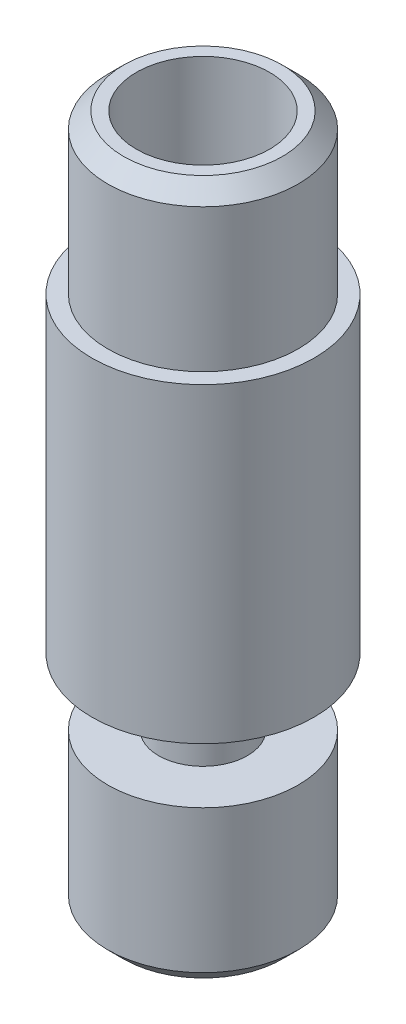
ISO-10303-21;
HEADER;
FILE_DESCRIPTION(('STEP AP214'),'2;1');
FILE_NAME('part.step','',(''),(''),'','','');
FILE_SCHEMA(('AUTOMOTIVE_DESIGN { 1 0 10303 214 1 1 1 1 }'));
ENDSEC;
DATA;
#1=APPLICATION_CONTEXT('core data for automotive mechanical design processes');
#2=APPLICATION_PROTOCOL_DEFINITION('international standard','automotive_design',2000,#1);
#3=PRODUCT_CONTEXT('',#1,'mechanical');
#4=PRODUCT('Part','Part','',(#3));
#5=PRODUCT_RELATED_PRODUCT_CATEGORY('part','',(#4));
#6=PRODUCT_DEFINITION_FORMATION('','',#4);
#7=PRODUCT_DEFINITION_CONTEXT('part definition',#1,'design');
#8=PRODUCT_DEFINITION('design','',#6,#7);
#9=PRODUCT_DEFINITION_SHAPE('','',#8);
#10=(LENGTH_UNIT() NAMED_UNIT(*) SI_UNIT(.MILLI.,.METRE.));
#11=(NAMED_UNIT(*) PLANE_ANGLE_UNIT() SI_UNIT($,.RADIAN.));
#12=(NAMED_UNIT(*) SI_UNIT($,.STERADIAN.) SOLID_ANGLE_UNIT());
#13=UNCERTAINTY_MEASURE_WITH_UNIT(LENGTH_MEASURE(1.E-05),#10,'distance_accuracy_value','');
#14=(GEOMETRIC_REPRESENTATION_CONTEXT(3) GLOBAL_UNCERTAINTY_ASSIGNED_CONTEXT((#13)) GLOBAL_UNIT_ASSIGNED_CONTEXT((#10,
#11,#12)) REPRESENTATION_CONTEXT('',''));
#15=CARTESIAN_POINT('',(0.,0.,0.));
#16=DIRECTION('',(0.,0.,1.));
#17=DIRECTION('',(1.,0.,0.));
#18=AXIS2_PLACEMENT_3D('',#15,#16,#17);
#19=CARTESIAN_POINT('',(0.,0.499999999999998,0.));
#20=DIRECTION('',(0.,1.,0.));
#21=DIRECTION('',(0.,0.,1.));
#22=AXIS2_PLACEMENT_3D('',#19,#20,#21);
#23=CONICAL_SURFACE('',#22,3.,0.78539816339745);
#24=CARTESIAN_POINT('',(0.,2.72844996841357E-11,0.));
#25=DIRECTION('',(0.,1.,0.));
#26=DIRECTION('',(0.,0.,1.));
#27=AXIS2_PLACEMENT_3D('',#24,#25,#26);
#28=CIRCLE('',#27,2.50000000002728);
#29=CARTESIAN_POINT('',(0.,2.72844996841357E-11,2.50000000002728));
#30=VERTEX_POINT('',#29);
#31=EDGE_CURVE('E79',#30,#30,#28,.T.);
#32=ORIENTED_EDGE('',*,*,#31,.T.);
#33=EDGE_LOOP('',(#32));
#34=FACE_BOUND('',#33,.T.);
#35=CARTESIAN_POINT('',(0.,0.499999999999998,0.));
#36=DIRECTION('',(0.,1.,0.));
#37=DIRECTION('',(0.,0.,1.));
#38=AXIS2_PLACEMENT_3D('',#35,#36,#37);
#39=CIRCLE('',#38,3.);
#40=CARTESIAN_POINT('',(0.,0.499999999999998,3.));
#41=VERTEX_POINT('',#40);
#42=EDGE_CURVE('E10',#41,#41,#39,.T.);
#43=ORIENTED_EDGE('',*,*,#42,.F.);
#44=EDGE_LOOP('',(#43));
#45=FACE_BOUND('',#44,.T.);
#46=ADVANCED_FACE('F33',(#34,#45),#23,.T.);
#47=CARTESIAN_POINT('',(0.,0.,0.));
#48=DIRECTION('',(0.,1.,0.));
#49=DIRECTION('',(0.,0.,1.));
#50=AXIS2_PLACEMENT_3D('',#47,#48,#49);
#51=CYLINDRICAL_SURFACE('',#50,3.);
#52=ORIENTED_EDGE('',*,*,#42,.T.);
#53=EDGE_LOOP('',(#52));
#54=FACE_BOUND('',#53,.T.);
#55=CARTESIAN_POINT('',(0.,5.,0.));
#56=DIRECTION('',(0.,1.,0.));
#57=DIRECTION('',(0.,0.,1.));
#58=AXIS2_PLACEMENT_3D('',#55,#56,#57);
#59=CIRCLE('',#58,3.);
#60=CARTESIAN_POINT('',(0.,5.,3.));
#61=VERTEX_POINT('',#60);
#62=EDGE_CURVE('E39',#61,#61,#59,.T.);
#63=ORIENTED_EDGE('',*,*,#62,.F.);
#64=EDGE_LOOP('',(#63));
#65=FACE_BOUND('',#64,.T.);
#66=ADVANCED_FACE('F97',(#54,#65),#51,.T.);
#67=CARTESIAN_POINT('',(1.4,5.,0.));
#68=DIRECTION('',(0.,1.,0.));
#69=DIRECTION('',(0.,0.,1.));
#70=AXIS2_PLACEMENT_3D('',#67,#68,#69);
#71=PLANE('',#70);
#72=ORIENTED_EDGE('',*,*,#62,.T.);
#73=EDGE_LOOP('',(#72));
#74=FACE_BOUND('',#73,.T.);
#75=CARTESIAN_POINT('',(0.,5.,0.));
#76=DIRECTION('',(0.,1.,0.));
#77=DIRECTION('',(0.,0.,1.));
#78=AXIS2_PLACEMENT_3D('',#75,#76,#77);
#79=CIRCLE('',#78,1.4);
#80=CARTESIAN_POINT('',(0.,5.,1.4));
#81=VERTEX_POINT('',#80);
#82=EDGE_CURVE('E43',#81,#81,#79,.T.);
#83=ORIENTED_EDGE('',*,*,#82,.F.);
#84=EDGE_LOOP('',(#83));
#85=FACE_BOUND('',#84,.T.);
#86=ADVANCED_FACE('F101',(#74,#85),#71,.T.);
#87=CARTESIAN_POINT('',(0.,0.,0.));
#88=DIRECTION('',(0.,1.,0.));
#89=DIRECTION('',(0.,0.,1.));
#90=AXIS2_PLACEMENT_3D('',#87,#88,#89);
#91=CYLINDRICAL_SURFACE('',#90,1.4);
#92=ORIENTED_EDGE('',*,*,#82,.T.);
#93=EDGE_LOOP('',(#92));
#94=FACE_BOUND('',#93,.T.);
#95=CARTESIAN_POINT('',(0.,7.1,0.));
#96=DIRECTION('',(0.,1.,0.));
#97=DIRECTION('',(0.,0.,1.));
#98=AXIS2_PLACEMENT_3D('',#95,#96,#97);
#99=CIRCLE('',#98,1.4);
#100=CARTESIAN_POINT('',(0.,7.1,1.4));
#101=VERTEX_POINT('',#100);
#102=EDGE_CURVE('E47',#101,#101,#99,.T.);
#103=ORIENTED_EDGE('',*,*,#102,.F.);
#104=EDGE_LOOP('',(#103));
#105=FACE_BOUND('',#104,.T.);
#106=ADVANCED_FACE('F105',(#94,#105),#91,.T.);
#107=CARTESIAN_POINT('',(3.5,7.1,0.));
#108=DIRECTION('',(0.,-1.,0.));
#109=DIRECTION('',(0.,0.,-1.));
#110=AXIS2_PLACEMENT_3D('',#107,#108,#109);
#111=PLANE('',#110);
#112=ORIENTED_EDGE('',*,*,#102,.T.);
#113=EDGE_LOOP('',(#112));
#114=FACE_BOUND('',#113,.T.);
#115=CARTESIAN_POINT('',(0.,7.1,0.));
#116=DIRECTION('',(0.,1.,0.));
#117=DIRECTION('',(0.,0.,1.));
#118=AXIS2_PLACEMENT_3D('',#115,#116,#117);
#119=CIRCLE('',#118,3.5);
#120=CARTESIAN_POINT('',(0.,7.1,3.5));
#121=VERTEX_POINT('',#120);
#122=EDGE_CURVE('E52',#121,#121,#119,.T.);
#123=ORIENTED_EDGE('',*,*,#122,.F.);
#124=EDGE_LOOP('',(#123));
#125=FACE_BOUND('',#124,.T.);
#126=ADVANCED_FACE('F111',(#114,#125),#111,.T.);
#127=CARTESIAN_POINT('',(0.,0.,0.));
#128=DIRECTION('',(0.,1.,0.));
#129=DIRECTION('',(0.,0.,1.));
#130=AXIS2_PLACEMENT_3D('',#127,#128,#129);
#131=CYLINDRICAL_SURFACE('',#130,3.5);
#132=ORIENTED_EDGE('',*,*,#122,.T.);
#133=EDGE_LOOP('',(#132));
#134=FACE_BOUND('',#133,.T.);
#135=CARTESIAN_POINT('',(0.,16.9,0.));
#136=DIRECTION('',(0.,1.,0.));
#137=DIRECTION('',(0.,0.,1.));
#138=AXIS2_PLACEMENT_3D('',#135,#136,#137);
#139=CIRCLE('',#138,3.5);
#140=CARTESIAN_POINT('',(0.,16.9,3.5));
#141=VERTEX_POINT('',#140);
#142=EDGE_CURVE('E55',#141,#141,#139,.T.);
#143=ORIENTED_EDGE('',*,*,#142,.F.);
#144=EDGE_LOOP('',(#143));
#145=FACE_BOUND('',#144,.T.);
#146=ADVANCED_FACE('F115',(#134,#145),#131,.T.);
#147=CARTESIAN_POINT('',(3.,16.9,0.));
#148=DIRECTION('',(0.,1.,0.));
#149=DIRECTION('',(0.,0.,1.));
#150=AXIS2_PLACEMENT_3D('',#147,#148,#149);
#151=PLANE('',#150);
#152=ORIENTED_EDGE('',*,*,#142,.T.);
#153=EDGE_LOOP('',(#152));
#154=FACE_BOUND('',#153,.T.);
#155=CARTESIAN_POINT('',(0.,16.9,0.));
#156=DIRECTION('',(0.,1.,0.));
#157=DIRECTION('',(0.,0.,1.));
#158=AXIS2_PLACEMENT_3D('',#155,#156,#157);
#159=CIRCLE('',#158,3.);
#160=CARTESIAN_POINT('',(0.,16.9,3.));
#161=VERTEX_POINT('',#160);
#162=EDGE_CURVE('E58',#161,#161,#159,.T.);
#163=ORIENTED_EDGE('',*,*,#162,.F.);
#164=EDGE_LOOP('',(#163));
#165=FACE_BOUND('',#164,.T.);
#166=ADVANCED_FACE('F119',(#154,#165),#151,.T.);
#167=CARTESIAN_POINT('',(0.,0.,0.));
#168=DIRECTION('',(0.,1.,0.));
#169=DIRECTION('',(0.,0.,1.));
#170=AXIS2_PLACEMENT_3D('',#167,#168,#169);
#171=CYLINDRICAL_SURFACE('',#170,3.);
#172=ORIENTED_EDGE('',*,*,#162,.T.);
#173=EDGE_LOOP('',(#172));
#174=FACE_BOUND('',#173,.T.);
#175=CARTESIAN_POINT('',(0.,21.4,0.));
#176=DIRECTION('',(0.,1.,0.));
#177=DIRECTION('',(0.,0.,1.));
#178=AXIS2_PLACEMENT_3D('',#175,#176,#177);
#179=CIRCLE('',#178,3.);
#180=CARTESIAN_POINT('',(0.,21.4,3.));
#181=VERTEX_POINT('',#180);
#182=EDGE_CURVE('E61',#181,#181,#179,.T.);
#183=ORIENTED_EDGE('',*,*,#182,.F.);
#184=EDGE_LOOP('',(#183));
#185=FACE_BOUND('',#184,.T.);
#186=ADVANCED_FACE('F123',(#174,#185),#171,.T.);
#187=CARTESIAN_POINT('',(0.,21.8999999999809,0.));
#188=DIRECTION('',(0.,-1.,0.));
#189=DIRECTION('',(0.,0.,-1.));
#190=AXIS2_PLACEMENT_3D('',#187,#188,#189);
#191=CONICAL_SURFACE('',#190,2.50000000001905,0.78539816339745);
#192=ORIENTED_EDGE('',*,*,#182,.T.);
#193=EDGE_LOOP('',(#192));
#194=FACE_BOUND('',#193,.T.);
#195=CARTESIAN_POINT('',(0.,21.8999999999809,0.));
#196=DIRECTION('',(0.,1.,0.));
#197=DIRECTION('',(0.,0.,1.));
#198=AXIS2_PLACEMENT_3D('',#195,#196,#197);
#199=CIRCLE('',#198,2.50000000001905);
#200=CARTESIAN_POINT('',(0.,21.8999999999809,2.50000000001905));
#201=VERTEX_POINT('',#200);
#202=EDGE_CURVE('E64',#201,#201,#199,.T.);
#203=ORIENTED_EDGE('',*,*,#202,.F.);
#204=EDGE_LOOP('',(#203));
#205=FACE_BOUND('',#204,.T.);
#206=ADVANCED_FACE('F127',(#194,#205),#191,.T.);
#207=CARTESIAN_POINT('',(2.10000000002133,21.8999999999809,0.));
#208=DIRECTION('',(0.,1.,0.));
#209=DIRECTION('',(0.,0.,1.));
#210=AXIS2_PLACEMENT_3D('',#207,#208,#209);
#211=PLANE('',#210);
#212=ORIENTED_EDGE('',*,*,#202,.T.);
#213=EDGE_LOOP('',(#212));
#214=FACE_BOUND('',#213,.T.);
#215=CARTESIAN_POINT('',(0.,21.8999999999809,0.));
#216=DIRECTION('',(0.,1.,0.));
#217=DIRECTION('',(0.,0.,1.));
#218=AXIS2_PLACEMENT_3D('',#215,#216,#217);
#219=CIRCLE('',#218,2.10000000002133);
#220=CARTESIAN_POINT('',(0.,21.8999999999809,2.10000000002133));
#221=VERTEX_POINT('',#220);
#222=EDGE_CURVE('E67',#221,#221,#219,.T.);
#223=ORIENTED_EDGE('',*,*,#222,.F.);
#224=EDGE_LOOP('',(#223));
#225=FACE_BOUND('',#224,.T.);
#226=ADVANCED_FACE('F131',(#214,#225),#211,.T.);
#227=CARTESIAN_POINT('',(0.,0.,0.));
#228=DIRECTION('',(0.,1.,0.));
#229=DIRECTION('',(0.,0.,1.));
#230=AXIS2_PLACEMENT_3D('',#227,#228,#229);
#231=CYLINDRICAL_SURFACE('',#230,2.10000000002133);
#232=ORIENTED_EDGE('',*,*,#222,.T.);
#233=EDGE_LOOP('',(#232));
#234=FACE_BOUND('',#233,.T.);
#235=CARTESIAN_POINT('',(0.,16.8999999999809,0.));
#236=DIRECTION('',(0.,1.,0.));
#237=DIRECTION('',(0.,0.,1.));
#238=AXIS2_PLACEMENT_3D('',#235,#236,#237);
#239=CIRCLE('',#238,2.10000000002133);
#240=CARTESIAN_POINT('',(0.,16.8999999999809,2.10000000002133));
#241=VERTEX_POINT('',#240);
#242=EDGE_CURVE('E70',#241,#241,#239,.T.);
#243=ORIENTED_EDGE('',*,*,#242,.F.);
#244=EDGE_LOOP('',(#243));
#245=FACE_BOUND('',#244,.T.);
#246=ADVANCED_FACE('F135',(#234,#245),#231,.F.);
#247=CARTESIAN_POINT('',(0.,15.7999999999472,0.));
#248=DIRECTION('',(0.,1.,0.));
#249=DIRECTION('',(0.,0.,1.));
#250=AXIS2_PLACEMENT_3D('',#247,#248,#249);
#251=CONICAL_SURFACE('',#250,0.999999999987541,0.785398163397448);
#252=ORIENTED_EDGE('',*,*,#242,.T.);
#253=EDGE_LOOP('',(#252));
#254=FACE_BOUND('',#253,.T.);
#255=CARTESIAN_POINT('',(0.,15.7999999999472,0.));
#256=DIRECTION('',(0.,1.,0.));
#257=DIRECTION('',(0.,0.,1.));
#258=AXIS2_PLACEMENT_3D('',#255,#256,#257);
#259=CIRCLE('',#258,0.999999999987541);
#260=CARTESIAN_POINT('',(0.,15.7999999999472,0.999999999987541));
#261=VERTEX_POINT('',#260);
#262=EDGE_CURVE('E73',#261,#261,#259,.T.);
#263=ORIENTED_EDGE('',*,*,#262,.F.);
#264=EDGE_LOOP('',(#263));
#265=FACE_BOUND('',#264,.T.);
#266=ADVANCED_FACE('F93',(#254,#265),#251,.F.);
#267=CARTESIAN_POINT('',(0.,0.,0.));
#268=DIRECTION('',(0.,1.,0.));
#269=DIRECTION('',(0.,0.,1.));
#270=AXIS2_PLACEMENT_3D('',#267,#268,#269);
#271=CYLINDRICAL_SURFACE('',#270,0.999999999987541);
#272=ORIENTED_EDGE('',*,*,#262,.T.);
#273=EDGE_LOOP('',(#272));
#274=FACE_BOUND('',#273,.T.);
#275=CARTESIAN_POINT('',(0.,2.72844996841357E-11,0.));
#276=DIRECTION('',(0.,1.,0.));
#277=DIRECTION('',(0.,0.,1.));
#278=AXIS2_PLACEMENT_3D('',#275,#276,#277);
#279=CIRCLE('',#278,0.999999999987541);
#280=CARTESIAN_POINT('',(0.,2.72844996841357E-11,0.999999999987541));
#281=VERTEX_POINT('',#280);
#282=EDGE_CURVE('E76',#281,#281,#279,.T.);
#283=ORIENTED_EDGE('',*,*,#282,.F.);
#284=EDGE_LOOP('',(#283));
#285=FACE_BOUND('',#284,.T.);
#286=ADVANCED_FACE('F87',(#274,#285),#271,.F.);
#287=CARTESIAN_POINT('',(2.50000000002728,2.72844996841357E-11,0.));
#288=DIRECTION('',(0.,-1.,0.));
#289=DIRECTION('',(0.,0.,-1.));
#290=AXIS2_PLACEMENT_3D('',#287,#288,#289);
#291=PLANE('',#290);
#292=ORIENTED_EDGE('',*,*,#282,.T.);
#293=EDGE_LOOP('',(#292));
#294=FACE_BOUND('',#293,.T.);
#295=ORIENTED_EDGE('',*,*,#31,.F.);
#296=EDGE_LOOP('',(#295));
#297=FACE_BOUND('',#296,.T.);
#298=ADVANCED_FACE('F85',(#294,#297),#291,.T.);
#299=CLOSED_SHELL('',(#46,#66,#86,#106,#126,#146,#166,#186,#206,#226,#246,#266,#286,#298));
#300=MANIFOLD_SOLID_BREP('B2',#299);
#301=ADVANCED_BREP_SHAPE_REPRESENTATION('',(#18,#300),#14);
#302=SHAPE_DEFINITION_REPRESENTATION(#9,#301);
ENDSEC;
END-ISO-10303-21;
